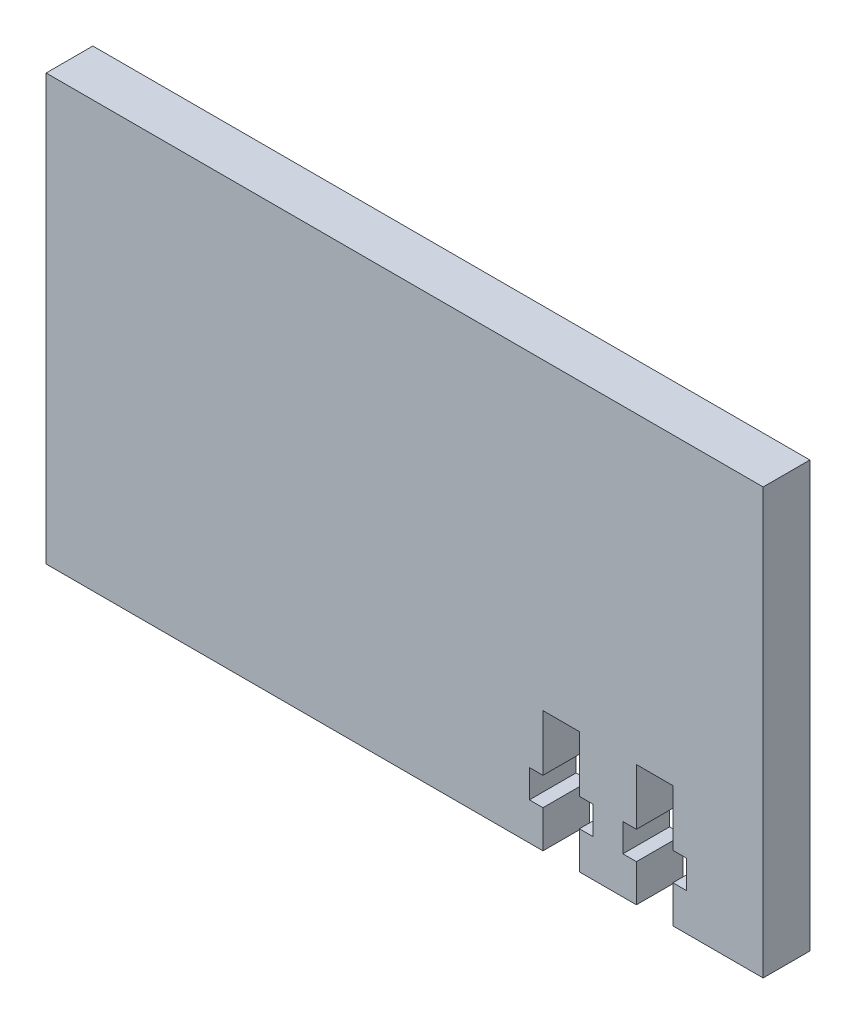
ISO-10303-21;
HEADER;
FILE_DESCRIPTION(('STEP AP214'),'2;1');
FILE_NAME('part.step','',(''),(''),'','','');
FILE_SCHEMA(('AUTOMOTIVE_DESIGN { 1 0 10303 214 1 1 1 1 }'));
ENDSEC;
DATA;
#1=APPLICATION_CONTEXT('core data for automotive mechanical design processes');
#2=APPLICATION_PROTOCOL_DEFINITION('international standard','automotive_design',2000,#1);
#3=PRODUCT_CONTEXT('',#1,'mechanical');
#4=PRODUCT('Part','Part','',(#3));
#5=PRODUCT_RELATED_PRODUCT_CATEGORY('part','',(#4));
#6=PRODUCT_DEFINITION_FORMATION('','',#4);
#7=PRODUCT_DEFINITION_CONTEXT('part definition',#1,'design');
#8=PRODUCT_DEFINITION('design','',#6,#7);
#9=PRODUCT_DEFINITION_SHAPE('','',#8);
#10=(LENGTH_UNIT() NAMED_UNIT(*) SI_UNIT(.MILLI.,.METRE.));
#11=(NAMED_UNIT(*) PLANE_ANGLE_UNIT() SI_UNIT($,.RADIAN.));
#12=(NAMED_UNIT(*) SI_UNIT($,.STERADIAN.) SOLID_ANGLE_UNIT());
#13=UNCERTAINTY_MEASURE_WITH_UNIT(LENGTH_MEASURE(1.E-05),#10,'distance_accuracy_value','');
#14=(GEOMETRIC_REPRESENTATION_CONTEXT(3) GLOBAL_UNCERTAINTY_ASSIGNED_CONTEXT((#13)) GLOBAL_UNIT_ASSIGNED_CONTEXT((#10,
#11,#12)) REPRESENTATION_CONTEXT('',''));
#15=CARTESIAN_POINT('',(0.,0.,0.));
#16=DIRECTION('',(0.,0.,1.));
#17=DIRECTION('',(1.,0.,0.));
#18=AXIS2_PLACEMENT_3D('',#15,#16,#17);
#19=CARTESIAN_POINT('',(-222.995661641974,-55.,-5.));
#20=DIRECTION('',(0.,1.,0.));
#21=DIRECTION('',(-1.,0.,0.));
#22=AXIS2_PLACEMENT_3D('',#19,#20,#21);
#23=PLANE('',#22);
#24=DIRECTION('',(-1.,0.,0.));
#25=VECTOR('',#24,1.);
#26=CARTESIAN_POINT('',(-222.995661641974,-55.,0.));
#27=LINE('',#26,#25);
#28=CARTESIAN_POINT('',(-146.2775,-55.,0.));
#29=VERTEX_POINT('',#28);
#30=CARTESIAN_POINT('',(-155.9375,-55.0000000000002,0.));
#31=VERTEX_POINT('',#30);
#32=EDGE_CURVE('E262',#29,#31,#27,.T.);
#33=ORIENTED_EDGE('',*,*,#32,.T.);
#34=DIRECTION('',(0.,0.,-1.));
#35=VECTOR('',#34,1.);
#36=CARTESIAN_POINT('',(-155.9375,-55.0000000000002,5.));
#37=LINE('',#36,#35);
#38=CARTESIAN_POINT('',(-155.9375,-55.0000000000002,-5.));
#39=VERTEX_POINT('',#38);
#40=EDGE_CURVE('E259',#31,#39,#37,.T.);
#41=ORIENTED_EDGE('',*,*,#40,.T.);
#42=DIRECTION('',(-1.,0.,0.));
#43=VECTOR('',#42,1.);
#44=CARTESIAN_POINT('',(-222.995661641974,-55.,-5.));
#45=LINE('',#44,#43);
#46=CARTESIAN_POINT('',(-146.2775,-55.,-5.));
#47=VERTEX_POINT('',#46);
#48=EDGE_CURVE('E244',#47,#39,#45,.T.);
#49=ORIENTED_EDGE('',*,*,#48,.F.);
#50=DIRECTION('',(0.,0.,1.));
#51=VECTOR('',#50,1.);
#52=CARTESIAN_POINT('',(-146.2775,-55.,-5.));
#53=LINE('',#52,#51);
#54=EDGE_CURVE('E274',#47,#29,#53,.T.);
#55=ORIENTED_EDGE('',*,*,#54,.T.);
#56=EDGE_LOOP('',(#33,#41,#49,#55));
#57=FACE_BOUND('',#56,.T.);
#58=ADVANCED_FACE('F35',(#57),#23,.F.);
#59=CARTESIAN_POINT('',(-159.8375,-55.0000000000002,-5.));
#60=VERTEX_POINT('',#59);
#61=CARTESIAN_POINT('',(-165.9375,-55.,-5.));
#62=VERTEX_POINT('',#61);
#63=EDGE_CURVE('E236',#60,#62,#45,.T.);
#64=ORIENTED_EDGE('',*,*,#63,.F.);
#65=DIRECTION('',(0.,0.,-1.));
#66=VECTOR('',#65,1.);
#67=CARTESIAN_POINT('',(-159.8375,-55.0000000000002,5.));
#68=LINE('',#67,#66);
#69=CARTESIAN_POINT('',(-159.8375,-55.0000000000002,0.));
#70=VERTEX_POINT('',#69);
#71=EDGE_CURVE('E218',#70,#60,#68,.T.);
#72=ORIENTED_EDGE('',*,*,#71,.F.);
#73=CARTESIAN_POINT('',(-165.9375,-55.,0.));
#74=VERTEX_POINT('',#73);
#75=EDGE_CURVE('E266',#70,#74,#27,.T.);
#76=ORIENTED_EDGE('',*,*,#75,.T.);
#77=DIRECTION('',(0.,0.,-1.));
#78=VECTOR('',#77,1.);
#79=CARTESIAN_POINT('',(-165.9375,-55.,5.));
#80=LINE('',#79,#78);
#81=EDGE_CURVE('E240',#74,#62,#80,.T.);
#82=ORIENTED_EDGE('',*,*,#81,.T.);
#83=EDGE_LOOP('',(#64,#72,#76,#82));
#84=FACE_BOUND('',#83,.T.);
#85=ADVANCED_FACE('F243',(#84),#23,.F.);
#86=CARTESIAN_POINT('',(-222.995661641974,-9.49999999999998,-5.));
#87=DIRECTION('',(0.,-1.,0.));
#88=DIRECTION('',(1.,0.,0.));
#89=AXIS2_PLACEMENT_3D('',#86,#87,#88);
#90=PLANE('',#89);
#91=DIRECTION('',(1.,0.,0.));
#92=VECTOR('',#91,1.);
#93=CARTESIAN_POINT('',(-222.995661641974,-9.49999999999998,0.));
#94=LINE('',#93,#92);
#95=CARTESIAN_POINT('',(-222.995661641974,-9.49999999999998,0.));
#96=VERTEX_POINT('',#95);
#97=CARTESIAN_POINT('',(-146.2775,-9.49999999999999,0.));
#98=VERTEX_POINT('',#97);
#99=EDGE_CURVE('E255',#96,#98,#94,.T.);
#100=ORIENTED_EDGE('',*,*,#99,.T.);
#101=DIRECTION('',(0.,0.,1.));
#102=VECTOR('',#101,1.);
#103=CARTESIAN_POINT('',(-146.2775,-9.49999999999999,-5.));
#104=LINE('',#103,#102);
#105=CARTESIAN_POINT('',(-146.2775,-9.49999999999999,-5.));
#106=VERTEX_POINT('',#105);
#107=EDGE_CURVE('E277',#106,#98,#104,.T.);
#108=ORIENTED_EDGE('',*,*,#107,.F.);
#109=DIRECTION('',(1.,0.,0.));
#110=VECTOR('',#109,1.);
#111=CARTESIAN_POINT('',(-222.995661641974,-9.49999999999998,-5.));
#112=LINE('',#111,#110);
#113=CARTESIAN_POINT('',(-222.995661641974,-9.49999999999998,-5.));
#114=VERTEX_POINT('',#113);
#115=EDGE_CURVE('E268',#114,#106,#112,.T.);
#116=ORIENTED_EDGE('',*,*,#115,.F.);
#117=DIRECTION('',(0.,0.,1.));
#118=VECTOR('',#117,1.);
#119=CARTESIAN_POINT('',(-222.995661641974,-9.49999999999998,-5.));
#120=LINE('',#119,#118);
#121=EDGE_CURVE('E254',#114,#96,#120,.T.);
#122=ORIENTED_EDGE('',*,*,#121,.T.);
#123=EDGE_LOOP('',(#100,#108,#116,#122));
#124=FACE_BOUND('',#123,.T.);
#125=ADVANCED_FACE('F37',(#124),#90,.F.);
#126=CARTESIAN_POINT('',(-146.2775,-9.49999999999999,-5.));
#127=DIRECTION('',(-1.,0.,0.));
#128=DIRECTION('',(0.,0.,1.));
#129=AXIS2_PLACEMENT_3D('',#126,#127,#128);
#130=PLANE('',#129);
#131=DIRECTION('',(0.,-1.,0.));
#132=VECTOR('',#131,1.);
#133=CARTESIAN_POINT('',(-146.2775,-9.49999999999999,0.));
#134=LINE('',#133,#132);
#135=EDGE_CURVE('E258',#98,#29,#134,.T.);
#136=ORIENTED_EDGE('',*,*,#135,.T.);
#137=ORIENTED_EDGE('',*,*,#54,.F.);
#138=DIRECTION('',(0.,-1.,0.));
#139=VECTOR('',#138,1.);
#140=CARTESIAN_POINT('',(-146.2775,-9.49999999999999,-5.));
#141=LINE('',#140,#139);
#142=EDGE_CURVE('E249',#106,#47,#141,.T.);
#143=ORIENTED_EDGE('',*,*,#142,.F.);
#144=ORIENTED_EDGE('',*,*,#107,.T.);
#145=EDGE_LOOP('',(#136,#137,#143,#144));
#146=FACE_BOUND('',#145,.T.);
#147=ADVANCED_FACE('F432',(#146),#130,.F.);
#148=CARTESIAN_POINT('',(-169.8375,-55.,-5.));
#149=VERTEX_POINT('',#148);
#150=CARTESIAN_POINT('',(-222.995661641974,-55.,-5.));
#151=VERTEX_POINT('',#150);
#152=EDGE_CURVE('E245',#149,#151,#45,.T.);
#153=ORIENTED_EDGE('',*,*,#152,.F.);
#154=DIRECTION('',(0.,0.,-1.));
#155=VECTOR('',#154,1.);
#156=CARTESIAN_POINT('',(-169.8375,-55.,5.));
#157=LINE('',#156,#155);
#158=CARTESIAN_POINT('',(-169.8375,-55.,0.));
#159=VERTEX_POINT('',#158);
#160=EDGE_CURVE('E405',#159,#149,#157,.T.);
#161=ORIENTED_EDGE('',*,*,#160,.F.);
#162=CARTESIAN_POINT('',(-222.995661641974,-55.,0.));
#163=VERTEX_POINT('',#162);
#164=EDGE_CURVE('E261',#159,#163,#27,.T.);
#165=ORIENTED_EDGE('',*,*,#164,.T.);
#166=DIRECTION('',(0.,0.,1.));
#167=VECTOR('',#166,1.);
#168=CARTESIAN_POINT('',(-222.995661641974,-55.,-5.));
#169=LINE('',#168,#167);
#170=EDGE_CURVE('E271',#151,#163,#169,.T.);
#171=ORIENTED_EDGE('',*,*,#170,.F.);
#172=EDGE_LOOP('',(#153,#161,#165,#171));
#173=FACE_BOUND('',#172,.T.);
#174=ADVANCED_FACE('F472',(#173),#23,.F.);
#175=CARTESIAN_POINT('',(-222.995661641974,-9.49999999999998,-5.));
#176=DIRECTION('',(1.,0.,0.));
#177=DIRECTION('',(0.,1.,0.));
#178=AXIS2_PLACEMENT_3D('',#175,#176,#177);
#179=PLANE('',#178);
#180=DIRECTION('',(0.,1.,0.));
#181=VECTOR('',#180,1.);
#182=CARTESIAN_POINT('',(-222.995661641974,-9.49999999999998,0.));
#183=LINE('',#182,#181);
#184=EDGE_CURVE('E265',#163,#96,#183,.T.);
#185=ORIENTED_EDGE('',*,*,#184,.T.);
#186=ORIENTED_EDGE('',*,*,#121,.F.);
#187=DIRECTION('',(0.,1.,0.));
#188=VECTOR('',#187,1.);
#189=CARTESIAN_POINT('',(-222.995661641974,-9.49999999999998,-5.));
#190=LINE('',#189,#188);
#191=EDGE_CURVE('E248',#151,#114,#190,.T.);
#192=ORIENTED_EDGE('',*,*,#191,.F.);
#193=ORIENTED_EDGE('',*,*,#170,.T.);
#194=EDGE_LOOP('',(#185,#186,#192,#193));
#195=FACE_BOUND('',#194,.T.);
#196=ADVANCED_FACE('F476',(#195),#179,.F.);
#197=CARTESIAN_POINT('',(0.,0.,-5.));
#198=DIRECTION('',(0.,0.,-1.));
#199=DIRECTION('',(-1.,0.,0.));
#200=AXIS2_PLACEMENT_3D('',#197,#198,#199);
#201=PLANE('',#200);
#202=DIRECTION('',(0.,-1.,0.));
#203=VECTOR('',#202,1.);
#204=CARTESIAN_POINT('',(-155.9375,-55.0000000000002,-5.));
#205=LINE('',#204,#203);
#206=CARTESIAN_POINT('',(-155.9375,-51.0000000000002,-5.));
#207=VERTEX_POINT('',#206);
#208=EDGE_CURVE('E229',#207,#39,#205,.T.);
#209=ORIENTED_EDGE('',*,*,#208,.F.);
#210=DIRECTION('',(-1.,0.,0.));
#211=VECTOR('',#210,1.);
#212=CARTESIAN_POINT('',(-155.9375,-51.0000000000002,-5.));
#213=LINE('',#212,#211);
#214=CARTESIAN_POINT('',(-154.487499999999,-51.0000000000002,-5.));
#215=VERTEX_POINT('',#214);
#216=EDGE_CURVE('E438',#215,#207,#213,.T.);
#217=ORIENTED_EDGE('',*,*,#216,.F.);
#218=DIRECTION('',(0.,-1.,0.));
#219=VECTOR('',#218,1.);
#220=CARTESIAN_POINT('',(-154.487499999999,-48.0000000000002,-5.));
#221=LINE('',#220,#219);
#222=CARTESIAN_POINT('',(-154.487499999999,-48.0000000000002,-5.));
#223=VERTEX_POINT('',#222);
#224=EDGE_CURVE('E353',#223,#215,#221,.T.);
#225=ORIENTED_EDGE('',*,*,#224,.F.);
#226=DIRECTION('',(1.,0.,0.));
#227=VECTOR('',#226,1.);
#228=CARTESIAN_POINT('',(-155.9375,-48.0000000000002,-5.));
#229=LINE('',#228,#227);
#230=CARTESIAN_POINT('',(-155.9375,-48.0000000000002,-5.));
#231=VERTEX_POINT('',#230);
#232=EDGE_CURVE('E441',#231,#223,#229,.T.);
#233=ORIENTED_EDGE('',*,*,#232,.F.);
#234=DIRECTION('',(0.,-1.,0.));
#235=VECTOR('',#234,1.);
#236=CARTESIAN_POINT('',(-155.9375,-48.0000000000002,-5.));
#237=LINE('',#236,#235);
#238=CARTESIAN_POINT('',(-155.9375,-42.,-5.));
#239=VERTEX_POINT('',#238);
#240=EDGE_CURVE('E444',#239,#231,#237,.T.);
#241=ORIENTED_EDGE('',*,*,#240,.F.);
#242=DIRECTION('',(1.,0.,0.));
#243=VECTOR('',#242,1.);
#244=CARTESIAN_POINT('',(-155.9375,-42.,-5.));
#245=LINE('',#244,#243);
#246=CARTESIAN_POINT('',(-159.8375,-42.,-5.));
#247=VERTEX_POINT('',#246);
#248=EDGE_CURVE('E447',#247,#239,#245,.T.);
#249=ORIENTED_EDGE('',*,*,#248,.F.);
#250=DIRECTION('',(0.,1.,0.));
#251=VECTOR('',#250,1.);
#252=CARTESIAN_POINT('',(-159.8375,-48.0000000000002,-5.));
#253=LINE('',#252,#251);
#254=CARTESIAN_POINT('',(-159.8375,-48.0000000000002,-5.));
#255=VERTEX_POINT('',#254);
#256=EDGE_CURVE('E450',#255,#247,#253,.T.);
#257=ORIENTED_EDGE('',*,*,#256,.F.);
#258=DIRECTION('',(1.,0.,0.));
#259=VECTOR('',#258,1.);
#260=CARTESIAN_POINT('',(-159.8375,-48.0000000000002,-5.));
#261=LINE('',#260,#259);
#262=CARTESIAN_POINT('',(-161.287500000001,-48.0000000000002,-5.));
#263=VERTEX_POINT('',#262);
#264=EDGE_CURVE('E453',#263,#255,#261,.T.);
#265=ORIENTED_EDGE('',*,*,#264,.F.);
#266=DIRECTION('',(0.,1.,0.));
#267=VECTOR('',#266,1.);
#268=CARTESIAN_POINT('',(-161.287500000001,-48.0000000000002,-5.));
#269=LINE('',#268,#267);
#270=CARTESIAN_POINT('',(-161.287500000001,-51.0000000000002,-5.));
#271=VERTEX_POINT('',#270);
#272=EDGE_CURVE('E456',#271,#263,#269,.T.);
#273=ORIENTED_EDGE('',*,*,#272,.F.);
#274=DIRECTION('',(-1.,0.,0.));
#275=VECTOR('',#274,1.);
#276=CARTESIAN_POINT('',(-159.8375,-51.0000000000002,-5.));
#277=LINE('',#276,#275);
#278=CARTESIAN_POINT('',(-159.8375,-51.0000000000002,-5.));
#279=VERTEX_POINT('',#278);
#280=EDGE_CURVE('E239',#279,#271,#277,.T.);
#281=ORIENTED_EDGE('',*,*,#280,.F.);
#282=DIRECTION('',(0.,1.,0.));
#283=VECTOR('',#282,1.);
#284=CARTESIAN_POINT('',(-159.8375,-55.0000000000002,-5.));
#285=LINE('',#284,#283);
#286=EDGE_CURVE('E221',#60,#279,#285,.T.);
#287=ORIENTED_EDGE('',*,*,#286,.F.);
#288=ORIENTED_EDGE('',*,*,#63,.T.);
#289=DIRECTION('',(0.,-1.,0.));
#290=VECTOR('',#289,1.);
#291=CARTESIAN_POINT('',(-165.9375,-55.,-5.));
#292=LINE('',#291,#290);
#293=CARTESIAN_POINT('',(-165.9375,-51.,-5.));
#294=VERTEX_POINT('',#293);
#295=EDGE_CURVE('E403',#294,#62,#292,.T.);
#296=ORIENTED_EDGE('',*,*,#295,.F.);
#297=DIRECTION('',(-1.,0.,0.));
#298=VECTOR('',#297,1.);
#299=CARTESIAN_POINT('',(-165.9375,-51.,-5.));
#300=LINE('',#299,#298);
#301=CARTESIAN_POINT('',(-164.4875,-51.,-5.));
#302=VERTEX_POINT('',#301);
#303=EDGE_CURVE('E400',#302,#294,#300,.T.);
#304=ORIENTED_EDGE('',*,*,#303,.F.);
#305=DIRECTION('',(0.,-1.,0.));
#306=VECTOR('',#305,1.);
#307=CARTESIAN_POINT('',(-164.4875,-48.,-5.));
#308=LINE('',#307,#306);
#309=CARTESIAN_POINT('',(-164.4875,-48.,-5.));
#310=VERTEX_POINT('',#309);
#311=EDGE_CURVE('E397',#310,#302,#308,.T.);
#312=ORIENTED_EDGE('',*,*,#311,.F.);
#313=DIRECTION('',(1.,0.,0.));
#314=VECTOR('',#313,1.);
#315=CARTESIAN_POINT('',(-165.9375,-48.,-5.));
#316=LINE('',#315,#314);
#317=CARTESIAN_POINT('',(-165.9375,-48.,-5.));
#318=VERTEX_POINT('',#317);
#319=EDGE_CURVE('E394',#318,#310,#316,.T.);
#320=ORIENTED_EDGE('',*,*,#319,.F.);
#321=DIRECTION('',(0.,-1.,0.));
#322=VECTOR('',#321,1.);
#323=CARTESIAN_POINT('',(-165.9375,-48.,-5.));
#324=LINE('',#323,#322);
#325=CARTESIAN_POINT('',(-165.9375,-42.,-5.));
#326=VERTEX_POINT('',#325);
#327=EDGE_CURVE('E391',#326,#318,#324,.T.);
#328=ORIENTED_EDGE('',*,*,#327,.F.);
#329=DIRECTION('',(1.,0.,0.));
#330=VECTOR('',#329,1.);
#331=CARTESIAN_POINT('',(-165.9375,-42.,-5.));
#332=LINE('',#331,#330);
#333=CARTESIAN_POINT('',(-169.8375,-42.,-5.));
#334=VERTEX_POINT('',#333);
#335=EDGE_CURVE('E388',#334,#326,#332,.T.);
#336=ORIENTED_EDGE('',*,*,#335,.F.);
#337=DIRECTION('',(0.,1.,0.));
#338=VECTOR('',#337,1.);
#339=CARTESIAN_POINT('',(-169.8375,-48.,-5.));
#340=LINE('',#339,#338);
#341=CARTESIAN_POINT('',(-169.8375,-48.,-5.));
#342=VERTEX_POINT('',#341);
#343=EDGE_CURVE('E385',#342,#334,#340,.T.);
#344=ORIENTED_EDGE('',*,*,#343,.F.);
#345=DIRECTION('',(1.,0.,0.));
#346=VECTOR('',#345,1.);
#347=CARTESIAN_POINT('',(-169.8375,-48.,-5.));
#348=LINE('',#347,#346);
#349=CARTESIAN_POINT('',(-171.2875,-48.,-5.));
#350=VERTEX_POINT('',#349);
#351=EDGE_CURVE('E382',#350,#342,#348,.T.);
#352=ORIENTED_EDGE('',*,*,#351,.F.);
#353=DIRECTION('',(0.,1.,0.));
#354=VECTOR('',#353,1.);
#355=CARTESIAN_POINT('',(-171.2875,-48.,-5.));
#356=LINE('',#355,#354);
#357=CARTESIAN_POINT('',(-171.2875,-51.,-5.));
#358=VERTEX_POINT('',#357);
#359=EDGE_CURVE('E379',#358,#350,#356,.T.);
#360=ORIENTED_EDGE('',*,*,#359,.F.);
#361=DIRECTION('',(-1.,0.,0.));
#362=VECTOR('',#361,1.);
#363=CARTESIAN_POINT('',(-169.8375,-51.,-5.));
#364=LINE('',#363,#362);
#365=CARTESIAN_POINT('',(-169.8375,-51.,-5.));
#366=VERTEX_POINT('',#365);
#367=EDGE_CURVE('E376',#366,#358,#364,.T.);
#368=ORIENTED_EDGE('',*,*,#367,.F.);
#369=DIRECTION('',(0.,1.,0.));
#370=VECTOR('',#369,1.);
#371=CARTESIAN_POINT('',(-169.8375,-55.,-5.));
#372=LINE('',#371,#370);
#373=EDGE_CURVE('E374',#149,#366,#372,.T.);
#374=ORIENTED_EDGE('',*,*,#373,.F.);
#375=ORIENTED_EDGE('',*,*,#152,.T.);
#376=ORIENTED_EDGE('',*,*,#191,.T.);
#377=ORIENTED_EDGE('',*,*,#115,.T.);
#378=ORIENTED_EDGE('',*,*,#142,.T.);
#379=ORIENTED_EDGE('',*,*,#48,.T.);
#380=EDGE_LOOP('',(#209,#217,#225,#233,#241,#249,#257,#265,#273,#281,#287,#288,#296,#304,#312,
#320,#328,#336,#344,#352,#360,#368,#374,#375,#376,#377,#378,#379));
#381=FACE_BOUND('',#380,.T.);
#382=ADVANCED_FACE('F234',(#381),#201,.T.);
#383=CARTESIAN_POINT('',(0.,0.,0.));
#384=DIRECTION('',(0.,0.,-1.));
#385=DIRECTION('',(-1.,0.,0.));
#386=AXIS2_PLACEMENT_3D('',#383,#384,#385);
#387=PLANE('',#386);
#388=DIRECTION('',(-1.,0.,0.));
#389=VECTOR('',#388,1.);
#390=CARTESIAN_POINT('',(0.,-51.0000000000002,0.));
#391=LINE('',#390,#389);
#392=CARTESIAN_POINT('',(-154.487499999999,-51.0000000000002,0.));
#393=VERTEX_POINT('',#392);
#394=CARTESIAN_POINT('',(-155.9375,-51.0000000000002,0.));
#395=VERTEX_POINT('',#394);
#396=EDGE_CURVE('E43',#393,#395,#391,.T.);
#397=ORIENTED_EDGE('',*,*,#396,.T.);
#398=DIRECTION('',(0.,-1.,0.));
#399=VECTOR('',#398,1.);
#400=CARTESIAN_POINT('',(-155.9375,0.,0.));
#401=LINE('',#400,#399);
#402=EDGE_CURVE('E11',#395,#31,#401,.T.);
#403=ORIENTED_EDGE('',*,*,#402,.T.);
#404=ORIENTED_EDGE('',*,*,#32,.F.);
#405=ORIENTED_EDGE('',*,*,#135,.F.);
#406=ORIENTED_EDGE('',*,*,#99,.F.);
#407=ORIENTED_EDGE('',*,*,#184,.F.);
#408=ORIENTED_EDGE('',*,*,#164,.F.);
#409=DIRECTION('',(0.,1.,0.));
#410=VECTOR('',#409,1.);
#411=CARTESIAN_POINT('',(-169.8375,1.17848439340484E-12,0.));
#412=LINE('',#411,#410);
#413=CARTESIAN_POINT('',(-169.8375,-51.,0.));
#414=VERTEX_POINT('',#413);
#415=EDGE_CURVE('E280',#159,#414,#412,.T.);
#416=ORIENTED_EDGE('',*,*,#415,.T.);
#417=DIRECTION('',(-1.,0.,0.));
#418=VECTOR('',#417,1.);
#419=CARTESIAN_POINT('',(-2.44057647654671E-13,-51.0000000000008,0.));
#420=LINE('',#419,#418);
#421=CARTESIAN_POINT('',(-171.2875,-51.,0.));
#422=VERTEX_POINT('',#421);
#423=EDGE_CURVE('E283',#414,#422,#420,.T.);
#424=ORIENTED_EDGE('',*,*,#423,.T.);
#425=DIRECTION('',(0.,1.,0.));
#426=VECTOR('',#425,1.);
#427=CARTESIAN_POINT('',(-171.2875,0.,0.));
#428=LINE('',#427,#426);
#429=CARTESIAN_POINT('',(-171.2875,-48.,0.));
#430=VERTEX_POINT('',#429);
#431=EDGE_CURVE('E286',#422,#430,#428,.T.);
#432=ORIENTED_EDGE('',*,*,#431,.T.);
#433=DIRECTION('',(1.,0.,0.));
#434=VECTOR('',#433,1.);
#435=CARTESIAN_POINT('',(-2.2970131543969E-13,-48.0000000000008,0.));
#436=LINE('',#435,#434);
#437=CARTESIAN_POINT('',(-169.8375,-48.,0.));
#438=VERTEX_POINT('',#437);
#439=EDGE_CURVE('E289',#430,#438,#436,.T.);
#440=ORIENTED_EDGE('',*,*,#439,.T.);
#441=DIRECTION('',(0.,1.,0.));
#442=VECTOR('',#441,1.);
#443=CARTESIAN_POINT('',(-169.8375,-7.85656262269896E-13,0.));
#444=LINE('',#443,#442);
#445=CARTESIAN_POINT('',(-169.8375,-42.,0.));
#446=VERTEX_POINT('',#445);
#447=EDGE_CURVE('E292',#438,#446,#444,.T.);
#448=ORIENTED_EDGE('',*,*,#447,.T.);
#449=DIRECTION('',(1.,0.,0.));
#450=VECTOR('',#449,1.);
#451=CARTESIAN_POINT('',(0.,-42.,0.));
#452=LINE('',#451,#450);
#453=CARTESIAN_POINT('',(-165.9375,-42.,0.));
#454=VERTEX_POINT('',#453);
#455=EDGE_CURVE('E295',#446,#454,#452,.T.);
#456=ORIENTED_EDGE('',*,*,#455,.T.);
#457=DIRECTION('',(0.,-1.,0.));
#458=VECTOR('',#457,1.);
#459=CARTESIAN_POINT('',(-165.9375,7.67615138119735E-13,0.));
#460=LINE('',#459,#458);
#461=CARTESIAN_POINT('',(-165.9375,-48.,0.));
#462=VERTEX_POINT('',#461);
#463=EDGE_CURVE('E298',#454,#462,#460,.T.);
#464=ORIENTED_EDGE('',*,*,#463,.T.);
#465=DIRECTION('',(1.,0.,0.));
#466=VECTOR('',#465,1.);
#467=CARTESIAN_POINT('',(2.29701315439683E-13,-47.9999999999992,0.));
#468=LINE('',#467,#466);
#469=CARTESIAN_POINT('',(-164.4875,-48.,0.));
#470=VERTEX_POINT('',#469);
#471=EDGE_CURVE('E301',#462,#470,#468,.T.);
#472=ORIENTED_EDGE('',*,*,#471,.T.);
#473=DIRECTION('',(0.,-1.,0.));
#474=VECTOR('',#473,1.);
#475=CARTESIAN_POINT('',(-164.4875,0.,0.));
#476=LINE('',#475,#474);
#477=CARTESIAN_POINT('',(-164.4875,-51.,0.));
#478=VERTEX_POINT('',#477);
#479=EDGE_CURVE('E304',#470,#478,#476,.T.);
#480=ORIENTED_EDGE('',*,*,#479,.T.);
#481=DIRECTION('',(-1.,0.,0.));
#482=VECTOR('',#481,1.);
#483=CARTESIAN_POINT('',(2.44057647654663E-13,-50.9999999999992,0.));
#484=LINE('',#483,#482);
#485=CARTESIAN_POINT('',(-165.9375,-51.,0.));
#486=VERTEX_POINT('',#485);
#487=EDGE_CURVE('E307',#478,#486,#484,.T.);
#488=ORIENTED_EDGE('',*,*,#487,.T.);
#489=DIRECTION('',(0.,-1.,0.));
#490=VECTOR('',#489,1.);
#491=CARTESIAN_POINT('',(-165.9375,0.,0.));
#492=LINE('',#491,#490);
#493=EDGE_CURVE('E310',#486,#74,#492,.T.);
#494=ORIENTED_EDGE('',*,*,#493,.T.);
#495=ORIENTED_EDGE('',*,*,#75,.F.);
#496=DIRECTION('',(0.,1.,0.));
#497=VECTOR('',#496,1.);
#498=CARTESIAN_POINT('',(-159.8375,-1.10909545436577E-12,0.));
#499=LINE('',#498,#497);
#500=CARTESIAN_POINT('',(-159.8375,-51.0000000000002,0.));
#501=VERTEX_POINT('',#500);
#502=EDGE_CURVE('E224',#70,#501,#499,.T.);
#503=ORIENTED_EDGE('',*,*,#502,.T.);
#504=DIRECTION('',(-1.,0.,0.));
#505=VECTOR('',#504,1.);
#506=CARTESIAN_POINT('',(0.,-51.0000000000002,0.));
#507=LINE('',#506,#505);
#508=CARTESIAN_POINT('',(-161.287500000001,-51.0000000000002,0.));
#509=VERTEX_POINT('',#508);
#510=EDGE_CURVE('E314',#501,#509,#507,.T.);
#511=ORIENTED_EDGE('',*,*,#510,.T.);
#512=DIRECTION('',(0.,1.,0.));
#513=VECTOR('',#512,1.);
#514=CARTESIAN_POINT('',(-161.287500000001,0.,0.));
#515=LINE('',#514,#513);
#516=CARTESIAN_POINT('',(-161.287500000001,-48.0000000000002,0.));
#517=VERTEX_POINT('',#516);
#518=EDGE_CURVE('E317',#509,#517,#515,.T.);
#519=ORIENTED_EDGE('',*,*,#518,.T.);
#520=DIRECTION('',(1.,0.,0.));
#521=VECTOR('',#520,1.);
#522=CARTESIAN_POINT('',(0.,-48.0000000000002,0.));
#523=LINE('',#522,#521);
#524=CARTESIAN_POINT('',(-159.8375,-48.0000000000002,0.));
#525=VERTEX_POINT('',#524);
#526=EDGE_CURVE('E320',#517,#525,#523,.T.);
#527=ORIENTED_EDGE('',*,*,#526,.T.);
#528=DIRECTION('',(0.,1.,0.));
#529=VECTOR('',#528,1.);
#530=CARTESIAN_POINT('',(-159.8375,0.,0.));
#531=LINE('',#530,#529);
#532=CARTESIAN_POINT('',(-159.8375,-42.,0.));
#533=VERTEX_POINT('',#532);
#534=EDGE_CURVE('E323',#525,#533,#531,.T.);
#535=ORIENTED_EDGE('',*,*,#534,.T.);
#536=DIRECTION('',(1.,0.,0.));
#537=VECTOR('',#536,1.);
#538=CARTESIAN_POINT('',(0.,-42.,0.));
#539=LINE('',#538,#537);
#540=CARTESIAN_POINT('',(-155.9375,-42.,0.));
#541=VERTEX_POINT('',#540);
#542=EDGE_CURVE('E326',#533,#541,#539,.T.);
#543=ORIENTED_EDGE('',*,*,#542,.T.);
#544=DIRECTION('',(0.,-1.,0.));
#545=VECTOR('',#544,1.);
#546=CARTESIAN_POINT('',(-155.9375,0.,0.));
#547=LINE('',#546,#545);
#548=CARTESIAN_POINT('',(-155.9375,-48.0000000000002,0.));
#549=VERTEX_POINT('',#548);
#550=EDGE_CURVE('E329',#541,#549,#547,.T.);
#551=ORIENTED_EDGE('',*,*,#550,.T.);
#552=DIRECTION('',(1.,0.,0.));
#553=VECTOR('',#552,1.);
#554=CARTESIAN_POINT('',(0.,-48.0000000000002,0.));
#555=LINE('',#554,#553);
#556=CARTESIAN_POINT('',(-154.487499999999,-48.0000000000002,0.));
#557=VERTEX_POINT('',#556);
#558=EDGE_CURVE('E332',#549,#557,#555,.T.);
#559=ORIENTED_EDGE('',*,*,#558,.T.);
#560=DIRECTION('',(0.,-1.,0.));
#561=VECTOR('',#560,1.);
#562=CARTESIAN_POINT('',(-154.487499999999,0.,0.));
#563=LINE('',#562,#561);
#564=EDGE_CURVE('E335',#557,#393,#563,.T.);
#565=ORIENTED_EDGE('',*,*,#564,.T.);
#566=EDGE_LOOP('',(#397,#403,#404,#405,#406,#407,#408,#416,#424,#432,#440,#448,#456,#464,#472,
#480,#488,#494,#495,#503,#511,#519,#527,#535,#543,#551,#559,#565));
#567=FACE_BOUND('',#566,.T.);
#568=ADVANCED_FACE('F339',(#567),#387,.F.);
#569=CARTESIAN_POINT('',(-165.9375,-55.,5.));
#570=DIRECTION('',(1.,0.,0.));
#571=DIRECTION('',(0.,0.,-1.));
#572=AXIS2_PLACEMENT_3D('',#569,#570,#571);
#573=PLANE('',#572);
#574=DIRECTION('',(0.,0.,-1.));
#575=VECTOR('',#574,1.);
#576=CARTESIAN_POINT('',(-165.9375,-51.,5.));
#577=LINE('',#576,#575);
#578=EDGE_CURVE('E407',#486,#294,#577,.T.);
#579=ORIENTED_EDGE('',*,*,#578,.T.);
#580=ORIENTED_EDGE('',*,*,#295,.T.);
#581=ORIENTED_EDGE('',*,*,#81,.F.);
#582=ORIENTED_EDGE('',*,*,#493,.F.);
#583=EDGE_LOOP('',(#579,#580,#581,#582));
#584=FACE_BOUND('',#583,.T.);
#585=ADVANCED_FACE('F501',(#584),#573,.F.);
#586=CARTESIAN_POINT('',(-165.9375,-51.,5.));
#587=DIRECTION('',(0.,-1.,0.));
#588=DIRECTION('',(1.,0.,0.));
#589=AXIS2_PLACEMENT_3D('',#586,#587,#588);
#590=PLANE('',#589);
#591=DIRECTION('',(0.,0.,-1.));
#592=VECTOR('',#591,1.);
#593=CARTESIAN_POINT('',(-164.4875,-51.,5.));
#594=LINE('',#593,#592);
#595=EDGE_CURVE('E409',#478,#302,#594,.T.);
#596=ORIENTED_EDGE('',*,*,#595,.T.);
#597=ORIENTED_EDGE('',*,*,#303,.T.);
#598=ORIENTED_EDGE('',*,*,#578,.F.);
#599=ORIENTED_EDGE('',*,*,#487,.F.);
#600=EDGE_LOOP('',(#596,#597,#598,#599));
#601=FACE_BOUND('',#600,.T.);
#602=ADVANCED_FACE('F538',(#601),#590,.F.);
#603=CARTESIAN_POINT('',(-164.4875,-48.,5.));
#604=DIRECTION('',(1.,0.,0.));
#605=DIRECTION('',(0.,0.,-1.));
#606=AXIS2_PLACEMENT_3D('',#603,#604,#605);
#607=PLANE('',#606);
#608=DIRECTION('',(0.,0.,-1.));
#609=VECTOR('',#608,1.);
#610=CARTESIAN_POINT('',(-164.4875,-48.,5.));
#611=LINE('',#610,#609);
#612=EDGE_CURVE('E411',#470,#310,#611,.T.);
#613=ORIENTED_EDGE('',*,*,#612,.T.);
#614=ORIENTED_EDGE('',*,*,#311,.T.);
#615=ORIENTED_EDGE('',*,*,#595,.F.);
#616=ORIENTED_EDGE('',*,*,#479,.F.);
#617=EDGE_LOOP('',(#613,#614,#615,#616));
#618=FACE_BOUND('',#617,.T.);
#619=ADVANCED_FACE('F534',(#618),#607,.F.);
#620=CARTESIAN_POINT('',(-165.9375,-48.,5.));
#621=DIRECTION('',(0.,1.,0.));
#622=DIRECTION('',(-1.,0.,0.));
#623=AXIS2_PLACEMENT_3D('',#620,#621,#622);
#624=PLANE('',#623);
#625=DIRECTION('',(0.,0.,-1.));
#626=VECTOR('',#625,1.);
#627=CARTESIAN_POINT('',(-165.9375,-48.,5.));
#628=LINE('',#627,#626);
#629=EDGE_CURVE('E413',#462,#318,#628,.T.);
#630=ORIENTED_EDGE('',*,*,#629,.T.);
#631=ORIENTED_EDGE('',*,*,#319,.T.);
#632=ORIENTED_EDGE('',*,*,#612,.F.);
#633=ORIENTED_EDGE('',*,*,#471,.F.);
#634=EDGE_LOOP('',(#630,#631,#632,#633));
#635=FACE_BOUND('',#634,.T.);
#636=ADVANCED_FACE('F530',(#635),#624,.F.);
#637=CARTESIAN_POINT('',(-165.9375,-48.,5.));
#638=DIRECTION('',(1.,0.,0.));
#639=DIRECTION('',(0.,1.,0.));
#640=AXIS2_PLACEMENT_3D('',#637,#638,#639);
#641=PLANE('',#640);
#642=DIRECTION('',(0.,0.,-1.));
#643=VECTOR('',#642,1.);
#644=CARTESIAN_POINT('',(-165.9375,-42.,5.));
#645=LINE('',#644,#643);
#646=EDGE_CURVE('E415',#454,#326,#645,.T.);
#647=ORIENTED_EDGE('',*,*,#646,.T.);
#648=ORIENTED_EDGE('',*,*,#327,.T.);
#649=ORIENTED_EDGE('',*,*,#629,.F.);
#650=ORIENTED_EDGE('',*,*,#463,.F.);
#651=EDGE_LOOP('',(#647,#648,#649,#650));
#652=FACE_BOUND('',#651,.T.);
#653=ADVANCED_FACE('F526',(#652),#641,.F.);
#654=CARTESIAN_POINT('',(-165.9375,-42.,5.));
#655=DIRECTION('',(0.,1.,0.));
#656=DIRECTION('',(0.,0.,1.));
#657=AXIS2_PLACEMENT_3D('',#654,#655,#656);
#658=PLANE('',#657);
#659=DIRECTION('',(0.,0.,-1.));
#660=VECTOR('',#659,1.);
#661=CARTESIAN_POINT('',(-169.8375,-42.,5.));
#662=LINE('',#661,#660);
#663=EDGE_CURVE('E417',#446,#334,#662,.T.);
#664=ORIENTED_EDGE('',*,*,#663,.T.);
#665=ORIENTED_EDGE('',*,*,#335,.T.);
#666=ORIENTED_EDGE('',*,*,#646,.F.);
#667=ORIENTED_EDGE('',*,*,#455,.F.);
#668=EDGE_LOOP('',(#664,#665,#666,#667));
#669=FACE_BOUND('',#668,.T.);
#670=ADVANCED_FACE('F522',(#669),#658,.F.);
#671=CARTESIAN_POINT('',(-169.8375,-48.,5.));
#672=DIRECTION('',(-1.,0.,0.));
#673=DIRECTION('',(0.,-1.,0.));
#674=AXIS2_PLACEMENT_3D('',#671,#672,#673);
#675=PLANE('',#674);
#676=DIRECTION('',(0.,0.,-1.));
#677=VECTOR('',#676,1.);
#678=CARTESIAN_POINT('',(-169.8375,-48.,5.));
#679=LINE('',#678,#677);
#680=EDGE_CURVE('E419',#438,#342,#679,.T.);
#681=ORIENTED_EDGE('',*,*,#680,.T.);
#682=ORIENTED_EDGE('',*,*,#343,.T.);
#683=ORIENTED_EDGE('',*,*,#663,.F.);
#684=ORIENTED_EDGE('',*,*,#447,.F.);
#685=EDGE_LOOP('',(#681,#682,#683,#684));
#686=FACE_BOUND('',#685,.T.);
#687=ADVANCED_FACE('F518',(#686),#675,.F.);
#688=CARTESIAN_POINT('',(-169.8375,-48.,5.));
#689=DIRECTION('',(0.,1.,0.));
#690=DIRECTION('',(-1.,0.,0.));
#691=AXIS2_PLACEMENT_3D('',#688,#689,#690);
#692=PLANE('',#691);
#693=DIRECTION('',(0.,0.,-1.));
#694=VECTOR('',#693,1.);
#695=CARTESIAN_POINT('',(-171.2875,-48.,5.));
#696=LINE('',#695,#694);
#697=EDGE_CURVE('E421',#430,#350,#696,.T.);
#698=ORIENTED_EDGE('',*,*,#697,.T.);
#699=ORIENTED_EDGE('',*,*,#351,.T.);
#700=ORIENTED_EDGE('',*,*,#680,.F.);
#701=ORIENTED_EDGE('',*,*,#439,.F.);
#702=EDGE_LOOP('',(#698,#699,#700,#701));
#703=FACE_BOUND('',#702,.T.);
#704=ADVANCED_FACE('F514',(#703),#692,.F.);
#705=CARTESIAN_POINT('',(-171.2875,-48.,5.));
#706=DIRECTION('',(-1.,0.,0.));
#707=DIRECTION('',(0.,0.,1.));
#708=AXIS2_PLACEMENT_3D('',#705,#706,#707);
#709=PLANE('',#708);
#710=DIRECTION('',(0.,0.,-1.));
#711=VECTOR('',#710,1.);
#712=CARTESIAN_POINT('',(-171.2875,-51.,5.));
#713=LINE('',#712,#711);
#714=EDGE_CURVE('E423',#422,#358,#713,.T.);
#715=ORIENTED_EDGE('',*,*,#714,.T.);
#716=ORIENTED_EDGE('',*,*,#359,.T.);
#717=ORIENTED_EDGE('',*,*,#697,.F.);
#718=ORIENTED_EDGE('',*,*,#431,.F.);
#719=EDGE_LOOP('',(#715,#716,#717,#718));
#720=FACE_BOUND('',#719,.T.);
#721=ADVANCED_FACE('F510',(#720),#709,.F.);
#722=CARTESIAN_POINT('',(-169.8375,-51.,5.));
#723=DIRECTION('',(0.,-1.,0.));
#724=DIRECTION('',(1.,0.,0.));
#725=AXIS2_PLACEMENT_3D('',#722,#723,#724);
#726=PLANE('',#725);
#727=DIRECTION('',(0.,0.,-1.));
#728=VECTOR('',#727,1.);
#729=CARTESIAN_POINT('',(-169.8375,-51.,5.));
#730=LINE('',#729,#728);
#731=EDGE_CURVE('E58',#414,#366,#730,.T.);
#732=ORIENTED_EDGE('',*,*,#731,.T.);
#733=ORIENTED_EDGE('',*,*,#367,.T.);
#734=ORIENTED_EDGE('',*,*,#714,.F.);
#735=ORIENTED_EDGE('',*,*,#423,.F.);
#736=EDGE_LOOP('',(#732,#733,#734,#735));
#737=FACE_BOUND('',#736,.T.);
#738=ADVANCED_FACE('F507',(#737),#726,.F.);
#739=CARTESIAN_POINT('',(-169.8375,-55.,5.));
#740=DIRECTION('',(-1.,0.,0.));
#741=DIRECTION('',(0.,-1.,0.));
#742=AXIS2_PLACEMENT_3D('',#739,#740,#741);
#743=PLANE('',#742);
#744=ORIENTED_EDGE('',*,*,#160,.T.);
#745=ORIENTED_EDGE('',*,*,#373,.T.);
#746=ORIENTED_EDGE('',*,*,#731,.F.);
#747=ORIENTED_EDGE('',*,*,#415,.F.);
#748=EDGE_LOOP('',(#744,#745,#746,#747));
#749=FACE_BOUND('',#748,.T.);
#750=ADVANCED_FACE('F503',(#749),#743,.F.);
#751=CARTESIAN_POINT('',(-155.9375,-55.0000000000002,5.));
#752=DIRECTION('',(1.,0.,0.));
#753=DIRECTION('',(0.,0.,-1.));
#754=AXIS2_PLACEMENT_3D('',#751,#752,#753);
#755=PLANE('',#754);
#756=DIRECTION('',(0.,0.,-1.));
#757=VECTOR('',#756,1.);
#758=CARTESIAN_POINT('',(-155.9375,-51.0000000000002,5.));
#759=LINE('',#758,#757);
#760=EDGE_CURVE('E348',#395,#207,#759,.T.);
#761=ORIENTED_EDGE('',*,*,#760,.T.);
#762=ORIENTED_EDGE('',*,*,#208,.T.);
#763=ORIENTED_EDGE('',*,*,#40,.F.);
#764=ORIENTED_EDGE('',*,*,#402,.F.);
#765=EDGE_LOOP('',(#761,#762,#763,#764));
#766=FACE_BOUND('',#765,.T.);
#767=ADVANCED_FACE('F506',(#766),#755,.F.);
#768=CARTESIAN_POINT('',(-155.9375,-51.0000000000002,5.));
#769=DIRECTION('',(0.,-1.,0.));
#770=DIRECTION('',(0.,0.,-1.));
#771=AXIS2_PLACEMENT_3D('',#768,#769,#770);
#772=PLANE('',#771);
#773=DIRECTION('',(0.,0.,-1.));
#774=VECTOR('',#773,1.);
#775=CARTESIAN_POINT('',(-154.487499999999,-51.0000000000002,5.));
#776=LINE('',#775,#774);
#777=EDGE_CURVE('E346',#393,#215,#776,.T.);
#778=ORIENTED_EDGE('',*,*,#777,.T.);
#779=ORIENTED_EDGE('',*,*,#216,.T.);
#780=ORIENTED_EDGE('',*,*,#760,.F.);
#781=ORIENTED_EDGE('',*,*,#396,.F.);
#782=EDGE_LOOP('',(#778,#779,#780,#781));
#783=FACE_BOUND('',#782,.T.);
#784=ADVANCED_FACE('F344',(#783),#772,.F.);
#785=CARTESIAN_POINT('',(-154.487499999999,-48.0000000000002,5.));
#786=DIRECTION('',(1.,0.,0.));
#787=DIRECTION('',(0.,0.,-1.));
#788=AXIS2_PLACEMENT_3D('',#785,#786,#787);
#789=PLANE('',#788);
#790=DIRECTION('',(0.,0.,-1.));
#791=VECTOR('',#790,1.);
#792=CARTESIAN_POINT('',(-154.487499999999,-48.0000000000002,5.));
#793=LINE('',#792,#791);
#794=EDGE_CURVE('E355',#557,#223,#793,.T.);
#795=ORIENTED_EDGE('',*,*,#794,.T.);
#796=ORIENTED_EDGE('',*,*,#224,.T.);
#797=ORIENTED_EDGE('',*,*,#777,.F.);
#798=ORIENTED_EDGE('',*,*,#564,.F.);
#799=EDGE_LOOP('',(#795,#796,#797,#798));
#800=FACE_BOUND('',#799,.T.);
#801=ADVANCED_FACE('F350',(#800),#789,.F.);
#802=CARTESIAN_POINT('',(-155.9375,-48.0000000000002,5.));
#803=DIRECTION('',(0.,1.,0.));
#804=DIRECTION('',(0.,0.,1.));
#805=AXIS2_PLACEMENT_3D('',#802,#803,#804);
#806=PLANE('',#805);
#807=DIRECTION('',(0.,0.,-1.));
#808=VECTOR('',#807,1.);
#809=CARTESIAN_POINT('',(-155.9375,-48.0000000000002,5.));
#810=LINE('',#809,#808);
#811=EDGE_CURVE('E358',#549,#231,#810,.T.);
#812=ORIENTED_EDGE('',*,*,#811,.T.);
#813=ORIENTED_EDGE('',*,*,#232,.T.);
#814=ORIENTED_EDGE('',*,*,#794,.F.);
#815=ORIENTED_EDGE('',*,*,#558,.F.);
#816=EDGE_LOOP('',(#812,#813,#814,#815));
#817=FACE_BOUND('',#816,.T.);
#818=ADVANCED_FACE('F567',(#817),#806,.F.);
#819=CARTESIAN_POINT('',(-155.9375,-48.0000000000002,5.));
#820=DIRECTION('',(1.,0.,0.));
#821=DIRECTION('',(0.,0.,-1.));
#822=AXIS2_PLACEMENT_3D('',#819,#820,#821);
#823=PLANE('',#822);
#824=DIRECTION('',(0.,0.,-1.));
#825=VECTOR('',#824,1.);
#826=CARTESIAN_POINT('',(-155.9375,-42.,5.));
#827=LINE('',#826,#825);
#828=EDGE_CURVE('E363',#541,#239,#827,.T.);
#829=ORIENTED_EDGE('',*,*,#828,.T.);
#830=ORIENTED_EDGE('',*,*,#240,.T.);
#831=ORIENTED_EDGE('',*,*,#811,.F.);
#832=ORIENTED_EDGE('',*,*,#550,.F.);
#833=EDGE_LOOP('',(#829,#830,#831,#832));
#834=FACE_BOUND('',#833,.T.);
#835=ADVANCED_FACE('F563',(#834),#823,.F.);
#836=CARTESIAN_POINT('',(-155.9375,-42.,5.));
#837=DIRECTION('',(0.,1.,0.));
#838=DIRECTION('',(0.,0.,1.));
#839=AXIS2_PLACEMENT_3D('',#836,#837,#838);
#840=PLANE('',#839);
#841=DIRECTION('',(0.,0.,-1.));
#842=VECTOR('',#841,1.);
#843=CARTESIAN_POINT('',(-159.8375,-42.,5.));
#844=LINE('',#843,#842);
#845=EDGE_CURVE('E365',#533,#247,#844,.T.);
#846=ORIENTED_EDGE('',*,*,#845,.T.);
#847=ORIENTED_EDGE('',*,*,#248,.T.);
#848=ORIENTED_EDGE('',*,*,#828,.F.);
#849=ORIENTED_EDGE('',*,*,#542,.F.);
#850=EDGE_LOOP('',(#846,#847,#848,#849));
#851=FACE_BOUND('',#850,.T.);
#852=ADVANCED_FACE('F559',(#851),#840,.F.);
#853=CARTESIAN_POINT('',(-159.8375,-48.0000000000002,5.));
#854=DIRECTION('',(-1.,0.,0.));
#855=DIRECTION('',(0.,0.,1.));
#856=AXIS2_PLACEMENT_3D('',#853,#854,#855);
#857=PLANE('',#856);
#858=DIRECTION('',(0.,0.,-1.));
#859=VECTOR('',#858,1.);
#860=CARTESIAN_POINT('',(-159.8375,-48.0000000000002,5.));
#861=LINE('',#860,#859);
#862=EDGE_CURVE('E367',#525,#255,#861,.T.);
#863=ORIENTED_EDGE('',*,*,#862,.T.);
#864=ORIENTED_EDGE('',*,*,#256,.T.);
#865=ORIENTED_EDGE('',*,*,#845,.F.);
#866=ORIENTED_EDGE('',*,*,#534,.F.);
#867=EDGE_LOOP('',(#863,#864,#865,#866));
#868=FACE_BOUND('',#867,.T.);
#869=ADVANCED_FACE('F555',(#868),#857,.F.);
#870=CARTESIAN_POINT('',(-159.8375,-48.0000000000002,5.));
#871=DIRECTION('',(0.,1.,0.));
#872=DIRECTION('',(0.,0.,1.));
#873=AXIS2_PLACEMENT_3D('',#870,#871,#872);
#874=PLANE('',#873);
#875=DIRECTION('',(0.,0.,-1.));
#876=VECTOR('',#875,1.);
#877=CARTESIAN_POINT('',(-161.287500000001,-48.0000000000002,5.));
#878=LINE('',#877,#876);
#879=EDGE_CURVE('E369',#517,#263,#878,.T.);
#880=ORIENTED_EDGE('',*,*,#879,.T.);
#881=ORIENTED_EDGE('',*,*,#264,.T.);
#882=ORIENTED_EDGE('',*,*,#862,.F.);
#883=ORIENTED_EDGE('',*,*,#526,.F.);
#884=EDGE_LOOP('',(#880,#881,#882,#883));
#885=FACE_BOUND('',#884,.T.);
#886=ADVANCED_FACE('F552',(#885),#874,.F.);
#887=CARTESIAN_POINT('',(-161.287500000001,-48.0000000000002,5.));
#888=DIRECTION('',(-1.,0.,0.));
#889=DIRECTION('',(0.,0.,1.));
#890=AXIS2_PLACEMENT_3D('',#887,#888,#889);
#891=PLANE('',#890);
#892=DIRECTION('',(0.,0.,-1.));
#893=VECTOR('',#892,1.);
#894=CARTESIAN_POINT('',(-161.287500000001,-51.0000000000002,5.));
#895=LINE('',#894,#893);
#896=EDGE_CURVE('E371',#509,#271,#895,.T.);
#897=ORIENTED_EDGE('',*,*,#896,.T.);
#898=ORIENTED_EDGE('',*,*,#272,.T.);
#899=ORIENTED_EDGE('',*,*,#879,.F.);
#900=ORIENTED_EDGE('',*,*,#518,.F.);
#901=EDGE_LOOP('',(#897,#898,#899,#900));
#902=FACE_BOUND('',#901,.T.);
#903=ADVANCED_FACE('F466',(#902),#891,.F.);
#904=CARTESIAN_POINT('',(-159.8375,-51.0000000000002,5.));
#905=DIRECTION('',(0.,-1.,0.));
#906=DIRECTION('',(0.,0.,-1.));
#907=AXIS2_PLACEMENT_3D('',#904,#905,#906);
#908=PLANE('',#907);
#909=DIRECTION('',(0.,0.,-1.));
#910=VECTOR('',#909,1.);
#911=CARTESIAN_POINT('',(-159.8375,-51.0000000000002,5.));
#912=LINE('',#911,#910);
#913=EDGE_CURVE('E50',#501,#279,#912,.T.);
#914=ORIENTED_EDGE('',*,*,#913,.T.);
#915=ORIENTED_EDGE('',*,*,#280,.T.);
#916=ORIENTED_EDGE('',*,*,#896,.F.);
#917=ORIENTED_EDGE('',*,*,#510,.F.);
#918=EDGE_LOOP('',(#914,#915,#916,#917));
#919=FACE_BOUND('',#918,.T.);
#920=ADVANCED_FACE('F461',(#919),#908,.F.);
#921=CARTESIAN_POINT('',(-159.8375,-55.0000000000002,5.));
#922=DIRECTION('',(-1.,0.,0.));
#923=DIRECTION('',(0.,-1.,0.));
#924=AXIS2_PLACEMENT_3D('',#921,#922,#923);
#925=PLANE('',#924);
#926=ORIENTED_EDGE('',*,*,#71,.T.);
#927=ORIENTED_EDGE('',*,*,#286,.T.);
#928=ORIENTED_EDGE('',*,*,#913,.F.);
#929=ORIENTED_EDGE('',*,*,#502,.F.);
#930=EDGE_LOOP('',(#926,#927,#928,#929));
#931=FACE_BOUND('',#930,.T.);
#932=ADVANCED_FACE('F220',(#931),#925,.F.);
#933=CLOSED_SHELL('',(#58,#85,#125,#147,#174,#196,#382,#568,#585,#602,#619,#636,#653,#670,#687,
#704,#721,#738,#750,#767,#784,#801,#818,#835,#852,#869,#886,#903,#920,#932));
#934=MANIFOLD_SOLID_BREP('B2',#933);
#935=ADVANCED_BREP_SHAPE_REPRESENTATION('',(#18,#934),#14);
#936=SHAPE_DEFINITION_REPRESENTATION(#9,#935);
ENDSEC;
END-ISO-10303-21;
